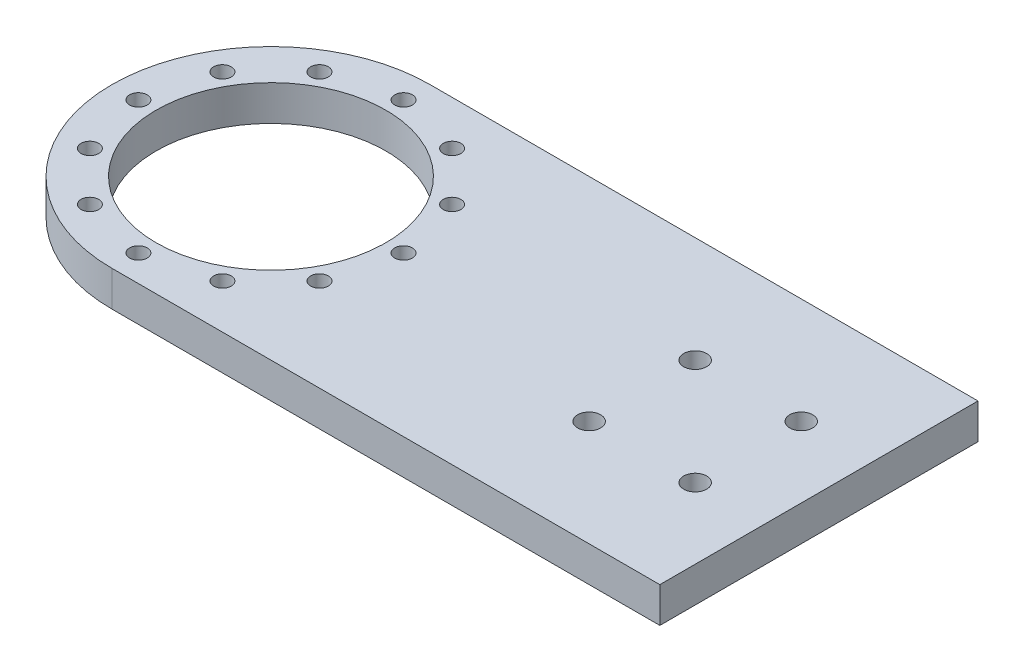
ISO-10303-21;
HEADER;
FILE_DESCRIPTION(('STEP AP214'),'2;1');
FILE_NAME('part.step','',(''),(''),'','','');
FILE_SCHEMA(('AUTOMOTIVE_DESIGN { 1 0 10303 214 1 1 1 1 }'));
ENDSEC;
DATA;
#1=APPLICATION_CONTEXT('core data for automotive mechanical design processes');
#2=APPLICATION_PROTOCOL_DEFINITION('international standard','automotive_design',2000,#1);
#3=PRODUCT_CONTEXT('',#1,'mechanical');
#4=PRODUCT('Part','Part','',(#3));
#5=PRODUCT_RELATED_PRODUCT_CATEGORY('part','',(#4));
#6=PRODUCT_DEFINITION_FORMATION('','',#4);
#7=PRODUCT_DEFINITION_CONTEXT('part definition',#1,'design');
#8=PRODUCT_DEFINITION('design','',#6,#7);
#9=PRODUCT_DEFINITION_SHAPE('','',#8);
#10=(LENGTH_UNIT() NAMED_UNIT(*) SI_UNIT(.MILLI.,.METRE.));
#11=(NAMED_UNIT(*) PLANE_ANGLE_UNIT() SI_UNIT($,.RADIAN.));
#12=(NAMED_UNIT(*) SI_UNIT($,.STERADIAN.) SOLID_ANGLE_UNIT());
#13=UNCERTAINTY_MEASURE_WITH_UNIT(LENGTH_MEASURE(1.E-05),#10,'distance_accuracy_value','');
#14=(GEOMETRIC_REPRESENTATION_CONTEXT(3) GLOBAL_UNCERTAINTY_ASSIGNED_CONTEXT((#13)) GLOBAL_UNIT_ASSIGNED_CONTEXT((#10,
#11,#12)) REPRESENTATION_CONTEXT('',''));
#15=CARTESIAN_POINT('',(0.,0.,0.));
#16=DIRECTION('',(0.,0.,1.));
#17=DIRECTION('',(1.,0.,0.));
#18=AXIS2_PLACEMENT_3D('',#15,#16,#17);
#19=CARTESIAN_POINT('',(0.,10.,-45.));
#20=DIRECTION('',(0.,0.,-1.));
#21=DIRECTION('',(-1.,0.,0.));
#22=AXIS2_PLACEMENT_3D('',#19,#20,#21);
#23=PLANE('',#22);
#24=DIRECTION('',(1.,0.,0.));
#25=VECTOR('',#24,1.);
#26=CARTESIAN_POINT('',(0.,0.,-45.));
#27=LINE('',#26,#25);
#28=CARTESIAN_POINT('',(-55.,0.,-45.));
#29=VERTEX_POINT('',#28);
#30=CARTESIAN_POINT('',(100.,0.,-45.));
#31=VERTEX_POINT('',#30);
#32=EDGE_CURVE('E98',#29,#31,#27,.T.);
#33=ORIENTED_EDGE('',*,*,#32,.F.);
#34=DIRECTION('',(0.,-1.,0.));
#35=VECTOR('',#34,1.);
#36=CARTESIAN_POINT('',(-55.,10.,-45.));
#37=LINE('',#36,#35);
#38=CARTESIAN_POINT('',(-55.,10.,-45.));
#39=VERTEX_POINT('',#38);
#40=EDGE_CURVE('E11',#39,#29,#37,.T.);
#41=ORIENTED_EDGE('',*,*,#40,.F.);
#42=DIRECTION('',(1.,0.,0.));
#43=VECTOR('',#42,1.);
#44=CARTESIAN_POINT('',(0.,10.,-45.));
#45=LINE('',#44,#43);
#46=CARTESIAN_POINT('',(100.,10.,-45.));
#47=VERTEX_POINT('',#46);
#48=EDGE_CURVE('E83',#39,#47,#45,.T.);
#49=ORIENTED_EDGE('',*,*,#48,.T.);
#50=DIRECTION('',(0.,-1.,0.));
#51=VECTOR('',#50,1.);
#52=CARTESIAN_POINT('',(100.,10.,-45.));
#53=LINE('',#52,#51);
#54=EDGE_CURVE('E51',#47,#31,#53,.T.);
#55=ORIENTED_EDGE('',*,*,#54,.T.);
#56=EDGE_LOOP('',(#33,#41,#49,#55));
#57=FACE_BOUND('',#56,.T.);
#58=ADVANCED_FACE('F35',(#57),#23,.T.);
#59=CARTESIAN_POINT('',(-55.,10.,0.));
#60=DIRECTION('',(0.,-1.,0.));
#61=DIRECTION('',(0.,0.,-1.));
#62=AXIS2_PLACEMENT_3D('',#59,#60,#61);
#63=CYLINDRICAL_SURFACE('',#62,45.);
#64=CARTESIAN_POINT('',(-55.,0.,0.));
#65=DIRECTION('',(0.,1.,0.));
#66=DIRECTION('',(0.,0.,1.));
#67=AXIS2_PLACEMENT_3D('',#64,#65,#66);
#68=CIRCLE('',#67,45.);
#69=CARTESIAN_POINT('',(-55.,0.,45.));
#70=VERTEX_POINT('',#69);
#71=EDGE_CURVE('E89',#29,#70,#68,.T.);
#72=ORIENTED_EDGE('',*,*,#71,.T.);
#73=DIRECTION('',(0.,-1.,0.));
#74=VECTOR('',#73,1.);
#75=CARTESIAN_POINT('',(-55.,10.,45.));
#76=LINE('',#75,#74);
#77=CARTESIAN_POINT('',(-55.,10.,45.));
#78=VERTEX_POINT('',#77);
#79=EDGE_CURVE('E43',#78,#70,#76,.T.);
#80=ORIENTED_EDGE('',*,*,#79,.F.);
#81=CARTESIAN_POINT('',(-55.,10.,0.));
#82=DIRECTION('',(0.,1.,0.));
#83=DIRECTION('',(0.,0.,1.));
#84=AXIS2_PLACEMENT_3D('',#81,#82,#83);
#85=CIRCLE('',#84,45.);
#86=EDGE_CURVE('E77',#39,#78,#85,.T.);
#87=ORIENTED_EDGE('',*,*,#86,.F.);
#88=ORIENTED_EDGE('',*,*,#40,.T.);
#89=EDGE_LOOP('',(#72,#80,#87,#88));
#90=FACE_BOUND('',#89,.T.);
#91=ADVANCED_FACE('F87',(#90),#63,.T.);
#92=CARTESIAN_POINT('',(0.,10.,45.));
#93=DIRECTION('',(0.,0.,1.));
#94=DIRECTION('',(1.,0.,0.));
#95=AXIS2_PLACEMENT_3D('',#92,#93,#94);
#96=PLANE('',#95);
#97=DIRECTION('',(-1.,0.,0.));
#98=VECTOR('',#97,1.);
#99=CARTESIAN_POINT('',(0.,0.,45.));
#100=LINE('',#99,#98);
#101=CARTESIAN_POINT('',(100.,0.,45.));
#102=VERTEX_POINT('',#101);
#103=EDGE_CURVE('E102',#102,#70,#100,.T.);
#104=ORIENTED_EDGE('',*,*,#103,.F.);
#105=DIRECTION('',(0.,-1.,0.));
#106=VECTOR('',#105,1.);
#107=CARTESIAN_POINT('',(100.,10.,45.));
#108=LINE('',#107,#106);
#109=CARTESIAN_POINT('',(100.,10.,45.));
#110=VERTEX_POINT('',#109);
#111=EDGE_CURVE('E64',#110,#102,#108,.T.);
#112=ORIENTED_EDGE('',*,*,#111,.F.);
#113=DIRECTION('',(-1.,0.,0.));
#114=VECTOR('',#113,1.);
#115=CARTESIAN_POINT('',(0.,10.,45.));
#116=LINE('',#115,#114);
#117=EDGE_CURVE('E82',#110,#78,#116,.T.);
#118=ORIENTED_EDGE('',*,*,#117,.T.);
#119=ORIENTED_EDGE('',*,*,#79,.T.);
#120=EDGE_LOOP('',(#104,#112,#118,#119));
#121=FACE_BOUND('',#120,.T.);
#122=ADVANCED_FACE('F92',(#121),#96,.T.);
#123=CARTESIAN_POINT('',(100.,10.,0.));
#124=DIRECTION('',(1.,0.,0.));
#125=DIRECTION('',(0.,0.,-1.));
#126=AXIS2_PLACEMENT_3D('',#123,#124,#125);
#127=PLANE('',#126);
#128=DIRECTION('',(0.,0.,1.));
#129=VECTOR('',#128,1.);
#130=CARTESIAN_POINT('',(100.,0.,0.));
#131=LINE('',#130,#129);
#132=EDGE_CURVE('E104',#31,#102,#131,.T.);
#133=ORIENTED_EDGE('',*,*,#132,.F.);
#134=ORIENTED_EDGE('',*,*,#54,.F.);
#135=DIRECTION('',(0.,0.,1.));
#136=VECTOR('',#135,1.);
#137=CARTESIAN_POINT('',(100.,10.,0.));
#138=LINE('',#137,#136);
#139=EDGE_CURVE('E93',#47,#110,#138,.T.);
#140=ORIENTED_EDGE('',*,*,#139,.T.);
#141=ORIENTED_EDGE('',*,*,#111,.T.);
#142=EDGE_LOOP('',(#133,#134,#140,#141));
#143=FACE_BOUND('',#142,.T.);
#144=ADVANCED_FACE('F217',(#143),#127,.T.);
#145=CARTESIAN_POINT('',(0.,10.,0.));
#146=DIRECTION('',(0.,1.,0.));
#147=DIRECTION('',(0.,0.,1.));
#148=AXIS2_PLACEMENT_3D('',#145,#146,#147);
#149=PLANE('',#148);
#150=CARTESIAN_POINT('',(50.,10.,15.));
#151=DIRECTION('',(0.,1.,0.));
#152=DIRECTION('',(0.,0.,1.));
#153=AXIS2_PLACEMENT_3D('',#150,#151,#152);
#154=CIRCLE('',#153,3.25);
#155=CARTESIAN_POINT('',(50.,10.,18.25));
#156=VERTEX_POINT('',#155);
#157=EDGE_CURVE('E197',#156,#156,#154,.T.);
#158=ORIENTED_EDGE('',*,*,#157,.F.);
#159=EDGE_LOOP('',(#158));
#160=FACE_BOUND('',#159,.T.);
#161=CARTESIAN_POINT('',(80.,10.,15.));
#162=DIRECTION('',(0.,1.,0.));
#163=DIRECTION('',(0.,0.,1.));
#164=AXIS2_PLACEMENT_3D('',#161,#162,#163);
#165=CIRCLE('',#164,3.25000000000001);
#166=CARTESIAN_POINT('',(80.,10.,18.25));
#167=VERTEX_POINT('',#166);
#168=EDGE_CURVE('E203',#167,#167,#165,.T.);
#169=ORIENTED_EDGE('',*,*,#168,.F.);
#170=EDGE_LOOP('',(#169));
#171=FACE_BOUND('',#170,.T.);
#172=CARTESIAN_POINT('',(80.,10.,-15.));
#173=DIRECTION('',(0.,1.,0.));
#174=DIRECTION('',(0.,0.,1.));
#175=AXIS2_PLACEMENT_3D('',#172,#173,#174);
#176=CIRCLE('',#175,3.25000000000001);
#177=CARTESIAN_POINT('',(80.,10.,-11.75));
#178=VERTEX_POINT('',#177);
#179=EDGE_CURVE('E191',#178,#178,#176,.T.);
#180=ORIENTED_EDGE('',*,*,#179,.F.);
#181=EDGE_LOOP('',(#180));
#182=FACE_BOUND('',#181,.T.);
#183=CARTESIAN_POINT('',(50.,10.,-15.));
#184=DIRECTION('',(0.,1.,0.));
#185=DIRECTION('',(0.,0.,1.));
#186=AXIS2_PLACEMENT_3D('',#183,#184,#185);
#187=CIRCLE('',#186,3.25);
#188=CARTESIAN_POINT('',(50.,10.,-11.75));
#189=VERTEX_POINT('',#188);
#190=EDGE_CURVE('E188',#189,#189,#187,.T.);
#191=ORIENTED_EDGE('',*,*,#190,.F.);
#192=EDGE_LOOP('',(#191));
#193=FACE_BOUND('',#192,.T.);
#194=CARTESIAN_POINT('',(-92.5,10.,0.));
#195=DIRECTION('',(0.,1.,0.));
#196=DIRECTION('',(0.,0.,1.));
#197=AXIS2_PLACEMENT_3D('',#194,#195,#196);
#198=CIRCLE('',#197,2.5);
#199=CARTESIAN_POINT('',(-92.5,10.,2.5));
#200=VERTEX_POINT('',#199);
#201=EDGE_CURVE('E117',#200,#200,#198,.T.);
#202=ORIENTED_EDGE('',*,*,#201,.F.);
#203=EDGE_LOOP('',(#202));
#204=FACE_BOUND('',#203,.T.);
#205=CARTESIAN_POINT('',(-87.4759526419166,10.,18.7499999999996));
#206=DIRECTION('',(0.,1.,0.));
#207=DIRECTION('',(0.,0.,1.));
#208=AXIS2_PLACEMENT_3D('',#205,#206,#207);
#209=CIRCLE('',#208,2.49999999999999);
#210=CARTESIAN_POINT('',(-87.4759526419166,10.,21.2499999999996));
#211=VERTEX_POINT('',#210);
#212=EDGE_CURVE('E160',#211,#211,#209,.T.);
#213=ORIENTED_EDGE('',*,*,#212,.F.);
#214=EDGE_LOOP('',(#213));
#215=FACE_BOUND('',#214,.T.);
#216=CARTESIAN_POINT('',(-73.7500000000004,10.,32.4759526419162));
#217=DIRECTION('',(0.,1.,0.));
#218=DIRECTION('',(0.,0.,1.));
#219=AXIS2_PLACEMENT_3D('',#216,#217,#218);
#220=CIRCLE('',#219,2.49999999999999);
#221=CARTESIAN_POINT('',(-73.7500000000004,10.,34.9759526419162));
#222=VERTEX_POINT('',#221);
#223=EDGE_CURVE('E167',#222,#222,#220,.T.);
#224=ORIENTED_EDGE('',*,*,#223,.F.);
#225=EDGE_LOOP('',(#224));
#226=FACE_BOUND('',#225,.T.);
#227=CARTESIAN_POINT('',(-55.0000000000004,10.,37.4999999999999));
#228=DIRECTION('',(0.,1.,0.));
#229=DIRECTION('',(0.,0.,1.));
#230=AXIS2_PLACEMENT_3D('',#227,#228,#229);
#231=CIRCLE('',#230,2.5);
#232=CARTESIAN_POINT('',(-55.0000000000004,10.,39.9999999999999));
#233=VERTEX_POINT('',#232);
#234=EDGE_CURVE('E173',#233,#233,#231,.T.);
#235=ORIENTED_EDGE('',*,*,#234,.F.);
#236=EDGE_LOOP('',(#235));
#237=FACE_BOUND('',#236,.T.);
#238=CARTESIAN_POINT('',(-36.2500000000003,10.,32.4759526419166));
#239=DIRECTION('',(0.,1.,0.));
#240=DIRECTION('',(0.,0.,1.));
#241=AXIS2_PLACEMENT_3D('',#238,#239,#240);
#242=CIRCLE('',#241,2.49999999999999);
#243=CARTESIAN_POINT('',(-36.2500000000003,10.,34.9759526419165));
#244=VERTEX_POINT('',#243);
#245=EDGE_CURVE('E179',#244,#244,#242,.T.);
#246=ORIENTED_EDGE('',*,*,#245,.F.);
#247=EDGE_LOOP('',(#246));
#248=FACE_BOUND('',#247,.T.);
#249=CARTESIAN_POINT('',(-54.9999999999999,10.,-37.5));
#250=DIRECTION('',(0.,1.,0.));
#251=DIRECTION('',(0.,0.,1.));
#252=AXIS2_PLACEMENT_3D('',#249,#250,#251);
#253=CIRCLE('',#252,2.49999999999999);
#254=CARTESIAN_POINT('',(-54.9999999999999,10.,-35.));
#255=VERTEX_POINT('',#254);
#256=EDGE_CURVE('E124',#255,#255,#253,.T.);
#257=ORIENTED_EDGE('',*,*,#256,.F.);
#258=EDGE_LOOP('',(#257));
#259=FACE_BOUND('',#258,.T.);
#260=CARTESIAN_POINT('',(-73.75,10.,-32.4759526419165));
#261=DIRECTION('',(0.,1.,0.));
#262=DIRECTION('',(0.,0.,1.));
#263=AXIS2_PLACEMENT_3D('',#260,#261,#262);
#264=CIRCLE('',#263,2.50000000000001);
#265=CARTESIAN_POINT('',(-73.75,10.,-29.9759526419165));
#266=VERTEX_POINT('',#265);
#267=EDGE_CURVE('E131',#266,#266,#264,.T.);
#268=ORIENTED_EDGE('',*,*,#267,.F.);
#269=EDGE_LOOP('',(#268));
#270=FACE_BOUND('',#269,.T.);
#271=CARTESIAN_POINT('',(-55.,10.,0.));
#272=DIRECTION('',(0.,1.,0.));
#273=DIRECTION('',(0.,0.,1.));
#274=AXIS2_PLACEMENT_3D('',#271,#272,#273);
#275=CIRCLE('',#274,32.5);
#276=CARTESIAN_POINT('',(-55.,10.,32.5));
#277=VERTEX_POINT('',#276);
#278=EDGE_CURVE('E110',#277,#277,#275,.T.);
#279=ORIENTED_EDGE('',*,*,#278,.F.);
#280=EDGE_LOOP('',(#279));
#281=FACE_BOUND('',#280,.T.);
#282=CARTESIAN_POINT('',(-87.4759526419162,10.,-18.7500000000005));
#283=DIRECTION('',(0.,1.,0.));
#284=DIRECTION('',(0.,0.,1.));
#285=AXIS2_PLACEMENT_3D('',#282,#283,#284);
#286=CIRCLE('',#285,2.5);
#287=CARTESIAN_POINT('',(-87.4759526419162,10.,-16.2500000000005));
#288=VERTEX_POINT('',#287);
#289=EDGE_CURVE('E118',#288,#288,#286,.T.);
#290=ORIENTED_EDGE('',*,*,#289,.F.);
#291=EDGE_LOOP('',(#290));
#292=FACE_BOUND('',#291,.T.);
#293=CARTESIAN_POINT('',(-36.2499999999999,10.,-32.4759526419164));
#294=DIRECTION('',(0.,1.,0.));
#295=DIRECTION('',(0.,0.,1.));
#296=AXIS2_PLACEMENT_3D('',#293,#294,#295);
#297=CIRCLE('',#296,2.49999999999999);
#298=CARTESIAN_POINT('',(-36.2499999999999,10.,-29.9759526419164));
#299=VERTEX_POINT('',#298);
#300=EDGE_CURVE('E155',#299,#299,#297,.T.);
#301=ORIENTED_EDGE('',*,*,#300,.F.);
#302=EDGE_LOOP('',(#301));
#303=FACE_BOUND('',#302,.T.);
#304=CARTESIAN_POINT('',(-22.5240473580835,10.,-18.7499999999998));
#305=DIRECTION('',(0.,1.,0.));
#306=DIRECTION('',(0.,0.,1.));
#307=AXIS2_PLACEMENT_3D('',#304,#305,#306);
#308=CIRCLE('',#307,2.49999999999999);
#309=CARTESIAN_POINT('',(-22.5240473580835,10.,-16.2499999999998));
#310=VERTEX_POINT('',#309);
#311=EDGE_CURVE('E149',#310,#310,#308,.T.);
#312=ORIENTED_EDGE('',*,*,#311,.F.);
#313=EDGE_LOOP('',(#312));
#314=FACE_BOUND('',#313,.T.);
#315=CARTESIAN_POINT('',(-17.5000000000001,10.,2.37587727269783E-13));
#316=DIRECTION('',(0.,1.,0.));
#317=DIRECTION('',(0.,0.,1.));
#318=AXIS2_PLACEMENT_3D('',#315,#316,#317);
#319=CIRCLE('',#318,2.49999999999999);
#320=CARTESIAN_POINT('',(-17.5000000000001,10.,2.50000000000023));
#321=VERTEX_POINT('',#320);
#322=EDGE_CURVE('E143',#321,#321,#319,.T.);
#323=ORIENTED_EDGE('',*,*,#322,.F.);
#324=EDGE_LOOP('',(#323));
#325=FACE_BOUND('',#324,.T.);
#326=CARTESIAN_POINT('',(-22.5240473580837,10.,18.7500000000002));
#327=DIRECTION('',(0.,1.,0.));
#328=DIRECTION('',(0.,0.,1.));
#329=AXIS2_PLACEMENT_3D('',#326,#327,#328);
#330=CIRCLE('',#329,2.49999999999999);
#331=CARTESIAN_POINT('',(-22.5240473580837,10.,21.2500000000002));
#332=VERTEX_POINT('',#331);
#333=EDGE_CURVE('E136',#332,#332,#330,.T.);
#334=ORIENTED_EDGE('',*,*,#333,.F.);
#335=EDGE_LOOP('',(#334));
#336=FACE_BOUND('',#335,.T.);
#337=ORIENTED_EDGE('',*,*,#48,.F.);
#338=ORIENTED_EDGE('',*,*,#86,.T.);
#339=ORIENTED_EDGE('',*,*,#117,.F.);
#340=ORIENTED_EDGE('',*,*,#139,.F.);
#341=EDGE_LOOP('',(#337,#338,#339,#340));
#342=FACE_BOUND('',#341,.T.);
#343=ADVANCED_FACE('F79',(#160,#171,#182,#193,#204,#215,#226,#237,#248,#259,#270,#281,#292,#303,
#314,#325,#336,#342),#149,.T.);
#344=CARTESIAN_POINT('',(0.,0.,0.));
#345=DIRECTION('',(0.,1.,0.));
#346=DIRECTION('',(0.,0.,1.));
#347=AXIS2_PLACEMENT_3D('',#344,#345,#346);
#348=PLANE('',#347);
#349=CARTESIAN_POINT('',(50.,0.,15.));
#350=DIRECTION('',(0.,1.,0.));
#351=DIRECTION('',(0.,0.,1.));
#352=AXIS2_PLACEMENT_3D('',#349,#350,#351);
#353=CIRCLE('',#352,3.25);
#354=CARTESIAN_POINT('',(50.,0.,18.25));
#355=VERTEX_POINT('',#354);
#356=EDGE_CURVE('E194',#355,#355,#353,.T.);
#357=ORIENTED_EDGE('',*,*,#356,.T.);
#358=EDGE_LOOP('',(#357));
#359=FACE_BOUND('',#358,.T.);
#360=CARTESIAN_POINT('',(80.,0.,15.));
#361=DIRECTION('',(0.,1.,0.));
#362=DIRECTION('',(0.,0.,1.));
#363=AXIS2_PLACEMENT_3D('',#360,#361,#362);
#364=CIRCLE('',#363,3.25000000000001);
#365=CARTESIAN_POINT('',(80.,0.,18.25));
#366=VERTEX_POINT('',#365);
#367=EDGE_CURVE('E200',#366,#366,#364,.T.);
#368=ORIENTED_EDGE('',*,*,#367,.T.);
#369=EDGE_LOOP('',(#368));
#370=FACE_BOUND('',#369,.T.);
#371=CARTESIAN_POINT('',(80.,0.,-15.));
#372=DIRECTION('',(0.,1.,0.));
#373=DIRECTION('',(0.,0.,1.));
#374=AXIS2_PLACEMENT_3D('',#371,#372,#373);
#375=CIRCLE('',#374,3.25000000000001);
#376=CARTESIAN_POINT('',(80.,0.,-11.75));
#377=VERTEX_POINT('',#376);
#378=EDGE_CURVE('E206',#377,#377,#375,.T.);
#379=ORIENTED_EDGE('',*,*,#378,.T.);
#380=EDGE_LOOP('',(#379));
#381=FACE_BOUND('',#380,.T.);
#382=CARTESIAN_POINT('',(50.,0.,-15.));
#383=DIRECTION('',(0.,1.,0.));
#384=DIRECTION('',(0.,0.,1.));
#385=AXIS2_PLACEMENT_3D('',#382,#383,#384);
#386=CIRCLE('',#385,3.25);
#387=CARTESIAN_POINT('',(50.,0.,-11.75));
#388=VERTEX_POINT('',#387);
#389=EDGE_CURVE('E164',#388,#388,#386,.T.);
#390=ORIENTED_EDGE('',*,*,#389,.T.);
#391=EDGE_LOOP('',(#390));
#392=FACE_BOUND('',#391,.T.);
#393=CARTESIAN_POINT('',(-92.5,0.,0.));
#394=DIRECTION('',(0.,1.,0.));
#395=DIRECTION('',(0.,0.,1.));
#396=AXIS2_PLACEMENT_3D('',#393,#394,#395);
#397=CIRCLE('',#396,2.5);
#398=CARTESIAN_POINT('',(-92.5,0.,2.5));
#399=VERTEX_POINT('',#398);
#400=EDGE_CURVE('E100',#399,#399,#397,.T.);
#401=ORIENTED_EDGE('',*,*,#400,.T.);
#402=EDGE_LOOP('',(#401));
#403=FACE_BOUND('',#402,.T.);
#404=CARTESIAN_POINT('',(-87.4759526419166,0.,18.7499999999996));
#405=DIRECTION('',(0.,1.,0.));
#406=DIRECTION('',(0.,0.,1.));
#407=AXIS2_PLACEMENT_3D('',#404,#405,#406);
#408=CIRCLE('',#407,2.49999999999999);
#409=CARTESIAN_POINT('',(-87.4759526419166,0.,21.2499999999996));
#410=VERTEX_POINT('',#409);
#411=EDGE_CURVE('E163',#410,#410,#408,.T.);
#412=ORIENTED_EDGE('',*,*,#411,.T.);
#413=EDGE_LOOP('',(#412));
#414=FACE_BOUND('',#413,.T.);
#415=CARTESIAN_POINT('',(-73.7500000000004,0.,32.4759526419162));
#416=DIRECTION('',(0.,1.,0.));
#417=DIRECTION('',(0.,0.,1.));
#418=AXIS2_PLACEMENT_3D('',#415,#416,#417);
#419=CIRCLE('',#418,2.49999999999999);
#420=CARTESIAN_POINT('',(-73.7500000000004,0.,34.9759526419162));
#421=VERTEX_POINT('',#420);
#422=EDGE_CURVE('E170',#421,#421,#419,.T.);
#423=ORIENTED_EDGE('',*,*,#422,.T.);
#424=EDGE_LOOP('',(#423));
#425=FACE_BOUND('',#424,.T.);
#426=CARTESIAN_POINT('',(-55.0000000000004,0.,37.4999999999999));
#427=DIRECTION('',(0.,1.,0.));
#428=DIRECTION('',(0.,0.,1.));
#429=AXIS2_PLACEMENT_3D('',#426,#427,#428);
#430=CIRCLE('',#429,2.5);
#431=CARTESIAN_POINT('',(-55.0000000000004,0.,39.9999999999999));
#432=VERTEX_POINT('',#431);
#433=EDGE_CURVE('E176',#432,#432,#430,.T.);
#434=ORIENTED_EDGE('',*,*,#433,.T.);
#435=EDGE_LOOP('',(#434));
#436=FACE_BOUND('',#435,.T.);
#437=CARTESIAN_POINT('',(-36.2500000000003,0.,32.4759526419166));
#438=DIRECTION('',(0.,1.,0.));
#439=DIRECTION('',(0.,0.,1.));
#440=AXIS2_PLACEMENT_3D('',#437,#438,#439);
#441=CIRCLE('',#440,2.49999999999999);
#442=CARTESIAN_POINT('',(-36.2500000000003,0.,34.9759526419165));
#443=VERTEX_POINT('',#442);
#444=EDGE_CURVE('E140',#443,#443,#441,.T.);
#445=ORIENTED_EDGE('',*,*,#444,.T.);
#446=EDGE_LOOP('',(#445));
#447=FACE_BOUND('',#446,.T.);
#448=CARTESIAN_POINT('',(-54.9999999999999,0.,-37.5));
#449=DIRECTION('',(0.,1.,0.));
#450=DIRECTION('',(0.,0.,1.));
#451=AXIS2_PLACEMENT_3D('',#448,#449,#450);
#452=CIRCLE('',#451,2.49999999999999);
#453=CARTESIAN_POINT('',(-54.9999999999999,0.,-35.));
#454=VERTEX_POINT('',#453);
#455=EDGE_CURVE('E127',#454,#454,#452,.T.);
#456=ORIENTED_EDGE('',*,*,#455,.T.);
#457=EDGE_LOOP('',(#456));
#458=FACE_BOUND('',#457,.T.);
#459=CARTESIAN_POINT('',(-73.75,0.,-32.4759526419165));
#460=DIRECTION('',(0.,1.,0.));
#461=DIRECTION('',(0.,0.,1.));
#462=AXIS2_PLACEMENT_3D('',#459,#460,#461);
#463=CIRCLE('',#462,2.50000000000001);
#464=CARTESIAN_POINT('',(-73.75,0.,-29.9759526419165));
#465=VERTEX_POINT('',#464);
#466=EDGE_CURVE('E121',#465,#465,#463,.T.);
#467=ORIENTED_EDGE('',*,*,#466,.T.);
#468=EDGE_LOOP('',(#467));
#469=FACE_BOUND('',#468,.T.);
#470=CARTESIAN_POINT('',(-55.,0.,0.));
#471=DIRECTION('',(0.,1.,0.));
#472=DIRECTION('',(0.,0.,1.));
#473=AXIS2_PLACEMENT_3D('',#470,#471,#472);
#474=CIRCLE('',#473,32.5);
#475=CARTESIAN_POINT('',(-55.,0.,32.5));
#476=VERTEX_POINT('',#475);
#477=EDGE_CURVE('E113',#476,#476,#474,.T.);
#478=ORIENTED_EDGE('',*,*,#477,.T.);
#479=EDGE_LOOP('',(#478));
#480=FACE_BOUND('',#479,.T.);
#481=CARTESIAN_POINT('',(-87.4759526419162,0.,-18.7500000000005));
#482=DIRECTION('',(0.,1.,0.));
#483=DIRECTION('',(0.,0.,1.));
#484=AXIS2_PLACEMENT_3D('',#481,#482,#483);
#485=CIRCLE('',#484,2.5);
#486=CARTESIAN_POINT('',(-87.4759526419162,0.,-16.2500000000005));
#487=VERTEX_POINT('',#486);
#488=EDGE_CURVE('E114',#487,#487,#485,.T.);
#489=ORIENTED_EDGE('',*,*,#488,.T.);
#490=EDGE_LOOP('',(#489));
#491=FACE_BOUND('',#490,.T.);
#492=CARTESIAN_POINT('',(-36.2499999999999,0.,-32.4759526419164));
#493=DIRECTION('',(0.,1.,0.));
#494=DIRECTION('',(0.,0.,1.));
#495=AXIS2_PLACEMENT_3D('',#492,#493,#494);
#496=CIRCLE('',#495,2.49999999999999);
#497=CARTESIAN_POINT('',(-36.2499999999999,0.,-29.9759526419164));
#498=VERTEX_POINT('',#497);
#499=EDGE_CURVE('E128',#498,#498,#496,.T.);
#500=ORIENTED_EDGE('',*,*,#499,.T.);
#501=EDGE_LOOP('',(#500));
#502=FACE_BOUND('',#501,.T.);
#503=CARTESIAN_POINT('',(-22.5240473580835,0.,-18.7499999999998));
#504=DIRECTION('',(0.,1.,0.));
#505=DIRECTION('',(0.,0.,1.));
#506=AXIS2_PLACEMENT_3D('',#503,#504,#505);
#507=CIRCLE('',#506,2.49999999999999);
#508=CARTESIAN_POINT('',(-22.5240473580835,0.,-16.2499999999998));
#509=VERTEX_POINT('',#508);
#510=EDGE_CURVE('E152',#509,#509,#507,.T.);
#511=ORIENTED_EDGE('',*,*,#510,.T.);
#512=EDGE_LOOP('',(#511));
#513=FACE_BOUND('',#512,.T.);
#514=CARTESIAN_POINT('',(-17.5000000000001,0.,2.37587727269783E-13));
#515=DIRECTION('',(0.,1.,0.));
#516=DIRECTION('',(0.,0.,1.));
#517=AXIS2_PLACEMENT_3D('',#514,#515,#516);
#518=CIRCLE('',#517,2.49999999999999);
#519=CARTESIAN_POINT('',(-17.5000000000001,0.,2.50000000000023));
#520=VERTEX_POINT('',#519);
#521=EDGE_CURVE('E146',#520,#520,#518,.T.);
#522=ORIENTED_EDGE('',*,*,#521,.T.);
#523=EDGE_LOOP('',(#522));
#524=FACE_BOUND('',#523,.T.);
#525=CARTESIAN_POINT('',(-22.5240473580837,0.,18.7500000000002));
#526=DIRECTION('',(0.,1.,0.));
#527=DIRECTION('',(0.,0.,1.));
#528=AXIS2_PLACEMENT_3D('',#525,#526,#527);
#529=CIRCLE('',#528,2.49999999999999);
#530=CARTESIAN_POINT('',(-22.5240473580837,0.,21.2500000000002));
#531=VERTEX_POINT('',#530);
#532=EDGE_CURVE('E139',#531,#531,#529,.T.);
#533=ORIENTED_EDGE('',*,*,#532,.T.);
#534=EDGE_LOOP('',(#533));
#535=FACE_BOUND('',#534,.T.);
#536=ORIENTED_EDGE('',*,*,#32,.T.);
#537=ORIENTED_EDGE('',*,*,#132,.T.);
#538=ORIENTED_EDGE('',*,*,#103,.T.);
#539=ORIENTED_EDGE('',*,*,#71,.F.);
#540=EDGE_LOOP('',(#536,#537,#538,#539));
#541=FACE_BOUND('',#540,.T.);
#542=ADVANCED_FACE('F216',(#359,#370,#381,#392,#403,#414,#425,#436,#447,#458,#469,#480,#491,
#502,#513,#524,#535,#541),#348,.F.);
#543=CARTESIAN_POINT('',(-22.5240473580837,0.,18.7500000000002));
#544=DIRECTION('',(0.,1.,0.));
#545=DIRECTION('',(0.,0.,1.));
#546=AXIS2_PLACEMENT_3D('',#543,#544,#545);
#547=CYLINDRICAL_SURFACE('',#546,2.49999999999999);
#548=ORIENTED_EDGE('',*,*,#532,.F.);
#549=EDGE_LOOP('',(#548));
#550=FACE_BOUND('',#549,.T.);
#551=ORIENTED_EDGE('',*,*,#333,.T.);
#552=EDGE_LOOP('',(#551));
#553=FACE_BOUND('',#552,.T.);
#554=ADVANCED_FACE('F248',(#550,#553),#547,.F.);
#555=CARTESIAN_POINT('',(-17.5000000000001,0.,2.37587727269783E-13));
#556=DIRECTION('',(0.,1.,0.));
#557=DIRECTION('',(0.,0.,1.));
#558=AXIS2_PLACEMENT_3D('',#555,#556,#557);
#559=CYLINDRICAL_SURFACE('',#558,2.49999999999999);
#560=ORIENTED_EDGE('',*,*,#521,.F.);
#561=EDGE_LOOP('',(#560));
#562=FACE_BOUND('',#561,.T.);
#563=ORIENTED_EDGE('',*,*,#322,.T.);
#564=EDGE_LOOP('',(#563));
#565=FACE_BOUND('',#564,.T.);
#566=ADVANCED_FACE('F250',(#562,#565),#559,.F.);
#567=CARTESIAN_POINT('',(-22.5240473580835,0.,-18.7499999999998));
#568=DIRECTION('',(0.,1.,0.));
#569=DIRECTION('',(0.,0.,1.));
#570=AXIS2_PLACEMENT_3D('',#567,#568,#569);
#571=CYLINDRICAL_SURFACE('',#570,2.49999999999999);
#572=ORIENTED_EDGE('',*,*,#510,.F.);
#573=EDGE_LOOP('',(#572));
#574=FACE_BOUND('',#573,.T.);
#575=ORIENTED_EDGE('',*,*,#311,.T.);
#576=EDGE_LOOP('',(#575));
#577=FACE_BOUND('',#576,.T.);
#578=ADVANCED_FACE('F257',(#574,#577),#571,.F.);
#579=CARTESIAN_POINT('',(-36.2499999999999,0.,-32.4759526419164));
#580=DIRECTION('',(0.,1.,0.));
#581=DIRECTION('',(0.,0.,1.));
#582=AXIS2_PLACEMENT_3D('',#579,#580,#581);
#583=CYLINDRICAL_SURFACE('',#582,2.49999999999999);
#584=ORIENTED_EDGE('',*,*,#499,.F.);
#585=EDGE_LOOP('',(#584));
#586=FACE_BOUND('',#585,.T.);
#587=ORIENTED_EDGE('',*,*,#300,.T.);
#588=EDGE_LOOP('',(#587));
#589=FACE_BOUND('',#588,.T.);
#590=ADVANCED_FACE('F283',(#586,#589),#583,.F.);
#591=CARTESIAN_POINT('',(-87.4759526419162,0.,-18.7500000000005));
#592=DIRECTION('',(0.,1.,0.));
#593=DIRECTION('',(0.,0.,1.));
#594=AXIS2_PLACEMENT_3D('',#591,#592,#593);
#595=CYLINDRICAL_SURFACE('',#594,2.5);
#596=ORIENTED_EDGE('',*,*,#488,.F.);
#597=EDGE_LOOP('',(#596));
#598=FACE_BOUND('',#597,.T.);
#599=ORIENTED_EDGE('',*,*,#289,.T.);
#600=EDGE_LOOP('',(#599));
#601=FACE_BOUND('',#600,.T.);
#602=ADVANCED_FACE('F279',(#598,#601),#595,.F.);
#603=CARTESIAN_POINT('',(-55.,0.,0.));
#604=DIRECTION('',(0.,1.,0.));
#605=DIRECTION('',(0.,0.,1.));
#606=AXIS2_PLACEMENT_3D('',#603,#604,#605);
#607=CYLINDRICAL_SURFACE('',#606,32.5);
#608=ORIENTED_EDGE('',*,*,#477,.F.);
#609=EDGE_LOOP('',(#608));
#610=FACE_BOUND('',#609,.T.);
#611=ORIENTED_EDGE('',*,*,#278,.T.);
#612=EDGE_LOOP('',(#611));
#613=FACE_BOUND('',#612,.T.);
#614=ADVANCED_FACE('F275',(#610,#613),#607,.F.);
#615=CARTESIAN_POINT('',(-73.75,0.,-32.4759526419165));
#616=DIRECTION('',(0.,1.,0.));
#617=DIRECTION('',(0.,0.,1.));
#618=AXIS2_PLACEMENT_3D('',#615,#616,#617);
#619=CYLINDRICAL_SURFACE('',#618,2.50000000000001);
#620=ORIENTED_EDGE('',*,*,#466,.F.);
#621=EDGE_LOOP('',(#620));
#622=FACE_BOUND('',#621,.T.);
#623=ORIENTED_EDGE('',*,*,#267,.T.);
#624=EDGE_LOOP('',(#623));
#625=FACE_BOUND('',#624,.T.);
#626=ADVANCED_FACE('F278',(#622,#625),#619,.F.);
#627=CARTESIAN_POINT('',(-54.9999999999999,0.,-37.5));
#628=DIRECTION('',(0.,1.,0.));
#629=DIRECTION('',(0.,0.,1.));
#630=AXIS2_PLACEMENT_3D('',#627,#628,#629);
#631=CYLINDRICAL_SURFACE('',#630,2.49999999999999);
#632=ORIENTED_EDGE('',*,*,#455,.F.);
#633=EDGE_LOOP('',(#632));
#634=FACE_BOUND('',#633,.T.);
#635=ORIENTED_EDGE('',*,*,#256,.T.);
#636=EDGE_LOOP('',(#635));
#637=FACE_BOUND('',#636,.T.);
#638=ADVANCED_FACE('F285',(#634,#637),#631,.F.);
#639=CARTESIAN_POINT('',(-36.2500000000003,0.,32.4759526419166));
#640=DIRECTION('',(0.,1.,0.));
#641=DIRECTION('',(0.,0.,1.));
#642=AXIS2_PLACEMENT_3D('',#639,#640,#641);
#643=CYLINDRICAL_SURFACE('',#642,2.49999999999999);
#644=ORIENTED_EDGE('',*,*,#444,.F.);
#645=EDGE_LOOP('',(#644));
#646=FACE_BOUND('',#645,.T.);
#647=ORIENTED_EDGE('',*,*,#245,.T.);
#648=EDGE_LOOP('',(#647));
#649=FACE_BOUND('',#648,.T.);
#650=ADVANCED_FACE('F287',(#646,#649),#643,.F.);
#651=CARTESIAN_POINT('',(-55.0000000000004,0.,37.4999999999999));
#652=DIRECTION('',(0.,1.,0.));
#653=DIRECTION('',(0.,0.,1.));
#654=AXIS2_PLACEMENT_3D('',#651,#652,#653);
#655=CYLINDRICAL_SURFACE('',#654,2.5);
#656=ORIENTED_EDGE('',*,*,#433,.F.);
#657=EDGE_LOOP('',(#656));
#658=FACE_BOUND('',#657,.T.);
#659=ORIENTED_EDGE('',*,*,#234,.T.);
#660=EDGE_LOOP('',(#659));
#661=FACE_BOUND('',#660,.T.);
#662=ADVANCED_FACE('F326',(#658,#661),#655,.F.);
#663=CARTESIAN_POINT('',(-73.7500000000004,0.,32.4759526419162));
#664=DIRECTION('',(0.,1.,0.));
#665=DIRECTION('',(0.,0.,1.));
#666=AXIS2_PLACEMENT_3D('',#663,#664,#665);
#667=CYLINDRICAL_SURFACE('',#666,2.49999999999999);
#668=ORIENTED_EDGE('',*,*,#422,.F.);
#669=EDGE_LOOP('',(#668));
#670=FACE_BOUND('',#669,.T.);
#671=ORIENTED_EDGE('',*,*,#223,.T.);
#672=EDGE_LOOP('',(#671));
#673=FACE_BOUND('',#672,.T.);
#674=ADVANCED_FACE('F322',(#670,#673),#667,.F.);
#675=CARTESIAN_POINT('',(-87.4759526419166,0.,18.7499999999996));
#676=DIRECTION('',(0.,1.,0.));
#677=DIRECTION('',(0.,0.,1.));
#678=AXIS2_PLACEMENT_3D('',#675,#676,#677);
#679=CYLINDRICAL_SURFACE('',#678,2.49999999999999);
#680=ORIENTED_EDGE('',*,*,#411,.F.);
#681=EDGE_LOOP('',(#680));
#682=FACE_BOUND('',#681,.T.);
#683=ORIENTED_EDGE('',*,*,#212,.T.);
#684=EDGE_LOOP('',(#683));
#685=FACE_BOUND('',#684,.T.);
#686=ADVANCED_FACE('F318',(#682,#685),#679,.F.);
#687=CARTESIAN_POINT('',(-92.5,0.,0.));
#688=DIRECTION('',(0.,1.,0.));
#689=DIRECTION('',(0.,0.,1.));
#690=AXIS2_PLACEMENT_3D('',#687,#688,#689);
#691=CYLINDRICAL_SURFACE('',#690,2.5);
#692=ORIENTED_EDGE('',*,*,#400,.F.);
#693=EDGE_LOOP('',(#692));
#694=FACE_BOUND('',#693,.T.);
#695=ORIENTED_EDGE('',*,*,#201,.T.);
#696=EDGE_LOOP('',(#695));
#697=FACE_BOUND('',#696,.T.);
#698=ADVANCED_FACE('F321',(#694,#697),#691,.F.);
#699=CARTESIAN_POINT('',(50.,0.,-15.));
#700=DIRECTION('',(0.,1.,0.));
#701=DIRECTION('',(0.,0.,1.));
#702=AXIS2_PLACEMENT_3D('',#699,#700,#701);
#703=CYLINDRICAL_SURFACE('',#702,3.25);
#704=ORIENTED_EDGE('',*,*,#389,.F.);
#705=EDGE_LOOP('',(#704));
#706=FACE_BOUND('',#705,.T.);
#707=ORIENTED_EDGE('',*,*,#190,.T.);
#708=EDGE_LOOP('',(#707));
#709=FACE_BOUND('',#708,.T.);
#710=ADVANCED_FACE('F336',(#706,#709),#703,.F.);
#711=CARTESIAN_POINT('',(80.,0.,-15.));
#712=DIRECTION('',(0.,1.,0.));
#713=DIRECTION('',(0.,0.,1.));
#714=AXIS2_PLACEMENT_3D('',#711,#712,#713);
#715=CYLINDRICAL_SURFACE('',#714,3.25000000000001);
#716=ORIENTED_EDGE('',*,*,#378,.F.);
#717=EDGE_LOOP('',(#716));
#718=FACE_BOUND('',#717,.T.);
#719=ORIENTED_EDGE('',*,*,#179,.T.);
#720=EDGE_LOOP('',(#719));
#721=FACE_BOUND('',#720,.T.);
#722=ADVANCED_FACE('F212',(#718,#721),#715,.F.);
#723=CARTESIAN_POINT('',(80.,0.,15.));
#724=DIRECTION('',(0.,1.,0.));
#725=DIRECTION('',(0.,0.,1.));
#726=AXIS2_PLACEMENT_3D('',#723,#724,#725);
#727=CYLINDRICAL_SURFACE('',#726,3.25000000000001);
#728=ORIENTED_EDGE('',*,*,#367,.F.);
#729=EDGE_LOOP('',(#728));
#730=FACE_BOUND('',#729,.T.);
#731=ORIENTED_EDGE('',*,*,#168,.T.);
#732=EDGE_LOOP('',(#731));
#733=FACE_BOUND('',#732,.T.);
#734=ADVANCED_FACE('F344',(#730,#733),#727,.F.);
#735=CARTESIAN_POINT('',(50.,0.,15.));
#736=DIRECTION('',(0.,1.,0.));
#737=DIRECTION('',(0.,0.,1.));
#738=AXIS2_PLACEMENT_3D('',#735,#736,#737);
#739=CYLINDRICAL_SURFACE('',#738,3.25);
#740=ORIENTED_EDGE('',*,*,#356,.F.);
#741=EDGE_LOOP('',(#740));
#742=FACE_BOUND('',#741,.T.);
#743=ORIENTED_EDGE('',*,*,#157,.T.);
#744=EDGE_LOOP('',(#743));
#745=FACE_BOUND('',#744,.T.);
#746=ADVANCED_FACE('F341',(#742,#745),#739,.F.);
#747=CLOSED_SHELL('',(#58,#91,#122,#144,#343,#542,#554,#566,#578,#590,#602,#614,#626,#638,#650,
#662,#674,#686,#698,#710,#722,#734,#746));
#748=MANIFOLD_SOLID_BREP('B2',#747);
#749=ADVANCED_BREP_SHAPE_REPRESENTATION('',(#18,#748),#14);
#750=SHAPE_DEFINITION_REPRESENTATION(#9,#749);
ENDSEC;
END-ISO-10303-21;
